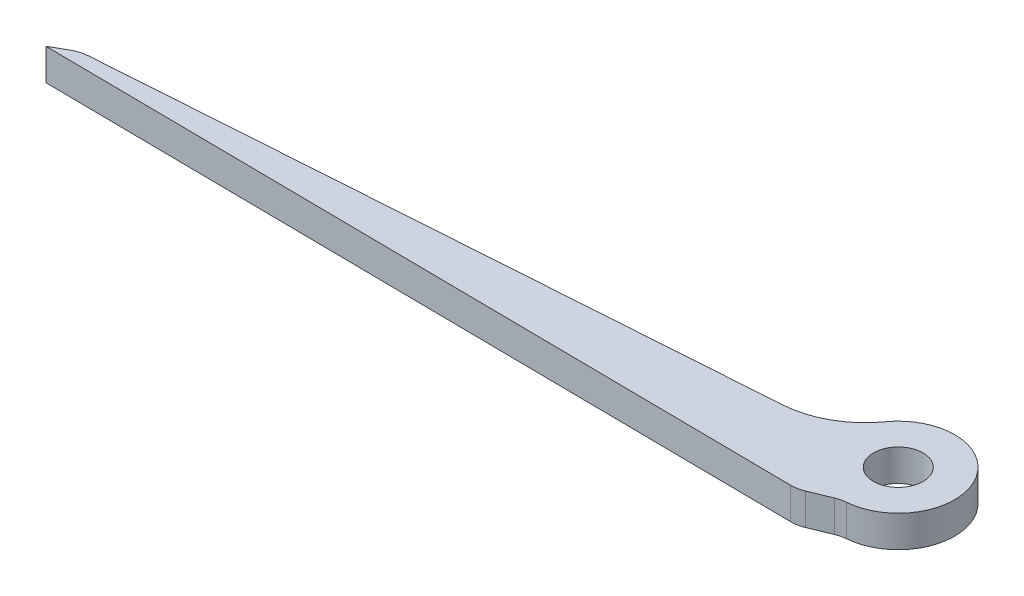
ISO-10303-21;
HEADER;
FILE_DESCRIPTION(('STEP AP214'),'2;1');
FILE_NAME('part.step','',(''),(''),'','','');
FILE_SCHEMA(('AUTOMOTIVE_DESIGN { 1 0 10303 214 1 1 1 1 }'));
ENDSEC;
DATA;
#1=APPLICATION_CONTEXT('core data for automotive mechanical design processes');
#2=APPLICATION_PROTOCOL_DEFINITION('international standard','automotive_design',2000,#1);
#3=PRODUCT_CONTEXT('',#1,'mechanical');
#4=PRODUCT('Part','Part','',(#3));
#5=PRODUCT_RELATED_PRODUCT_CATEGORY('part','',(#4));
#6=PRODUCT_DEFINITION_FORMATION('','',#4);
#7=PRODUCT_DEFINITION_CONTEXT('part definition',#1,'design');
#8=PRODUCT_DEFINITION('design','',#6,#7);
#9=PRODUCT_DEFINITION_SHAPE('','',#8);
#10=(LENGTH_UNIT() NAMED_UNIT(*) SI_UNIT(.MILLI.,.METRE.));
#11=(NAMED_UNIT(*) PLANE_ANGLE_UNIT() SI_UNIT($,.RADIAN.));
#12=(NAMED_UNIT(*) SI_UNIT($,.STERADIAN.) SOLID_ANGLE_UNIT());
#13=UNCERTAINTY_MEASURE_WITH_UNIT(LENGTH_MEASURE(1.E-05),#10,'distance_accuracy_value','');
#14=(GEOMETRIC_REPRESENTATION_CONTEXT(3) GLOBAL_UNCERTAINTY_ASSIGNED_CONTEXT((#13)) GLOBAL_UNIT_ASSIGNED_CONTEXT((#10,
#11,#12)) REPRESENTATION_CONTEXT('',''));
#15=CARTESIAN_POINT('',(0.,0.,0.));
#16=DIRECTION('',(0.,0.,1.));
#17=DIRECTION('',(1.,0.,0.));
#18=AXIS2_PLACEMENT_3D('',#15,#16,#17);
#19=CARTESIAN_POINT('',(0.,3.175,0.));
#20=DIRECTION('',(0.,1.,0.));
#21=DIRECTION('',(0.,0.,1.));
#22=AXIS2_PLACEMENT_3D('',#19,#20,#21);
#23=PLANE('',#22);
#24=CARTESIAN_POINT('',(0.,3.175,0.));
#25=DIRECTION('',(0.,1.,0.));
#26=DIRECTION('',(0.,0.,1.));
#27=AXIS2_PLACEMENT_3D('',#24,#25,#26);
#28=CIRCLE('',#27,5.6642);
#29=CARTESIAN_POINT('',(0.444946616900004,3.175,5.64669674660409));
#30=VERTEX_POINT('',#29);
#31=CARTESIAN_POINT('',(-4.60174845221113,3.175,-3.30258577823082));
#32=VERTEX_POINT('',#31);
#33=EDGE_CURVE('E162',#30,#32,#28,.T.);
#34=ORIENTED_EDGE('',*,*,#33,.T.);
#35=CARTESIAN_POINT('',(-11.8242236014214,3.175,-8.48601637186662));
#36=DIRECTION('',(0.,1.,0.));
#37=DIRECTION('',(0.,0.,1.));
#38=AXIS2_PLACEMENT_3D('',#35,#36,#37);
#39=CIRCLE('',#38,8.89);
#40=CARTESIAN_POINT('',(-11.2121421211736,3.175,0.382887521035677));
#41=VERTEX_POINT('',#40);
#42=EDGE_CURVE('E11',#32,#41,#39,.F.);
#43=ORIENTED_EDGE('',*,*,#42,.T.);
#44=DIRECTION('',(-0.997626984578437,0.,0.0688505602078505));
#45=VECTOR('',#44,1.);
#46=CARTESIAN_POINT('',(-5.6642,3.175,0.));
#47=LINE('',#46,#45);
#48=CARTESIAN_POINT('',(-76.4638174473622,3.175,4.8861883239979));
#49=VERTEX_POINT('',#48);
#50=EDGE_CURVE('E123',#41,#49,#47,.T.);
#51=ORIENTED_EDGE('',*,*,#50,.T.);
#52=CARTESIAN_POINT('',(-76.2452169187023,3.175,8.05365400003444));
#53=DIRECTION('',(0.,1.,0.));
#54=DIRECTION('',(0.,0.,1.));
#55=AXIS2_PLACEMENT_3D('',#52,#53,#54);
#56=CIRCLE('',#55,3.175);
#57=CARTESIAN_POINT('',(-77.8039136184842,3.175,5.28759369734959));
#58=VERTEX_POINT('',#57);
#59=EDGE_CURVE('E118',#49,#58,#56,.T.);
#60=ORIENTED_EDGE('',*,*,#59,.T.);
#61=DIRECTION('',(-0.871200095333811,0.,0.490928094419497));
#62=VECTOR('',#61,1.);
#63=CARTESIAN_POINT('',(-77.1791945502583,3.175,4.93555959708459));
#64=LINE('',#63,#62);
#65=CARTESIAN_POINT('',(-79.3920427924062,3.175,6.18251695691011));
#66=VERTEX_POINT('',#65);
#67=EDGE_CURVE('E111',#58,#66,#64,.T.);
#68=ORIENTED_EDGE('',*,*,#67,.T.);
#69=DIRECTION('',(0.999945461548254,0.,0.0104438464681303));
#70=VECTOR('',#69,1.);
#71=CARTESIAN_POINT('',(-79.3920427924062,3.175,6.18251695691011));
#72=LINE('',#71,#70);
#73=CARTESIAN_POINT('',(-3.83726556900571,3.175,6.97164248784978));
#74=VERTEX_POINT('',#73);
#75=EDGE_CURVE('E115',#66,#74,#72,.T.);
#76=ORIENTED_EDGE('',*,*,#75,.T.);
#77=CARTESIAN_POINT('',(-3.80410635646939,3.175,3.79681564743408));
#78=DIRECTION('',(0.,1.,0.));
#79=DIRECTION('',(0.,0.,1.));
#80=AXIS2_PLACEMENT_3D('',#77,#78,#79);
#81=CIRCLE('',#80,3.175);
#82=CARTESIAN_POINT('',(-2.59537443766945,3.175,6.73272984040263));
#83=VERTEX_POINT('',#82);
#84=EDGE_CURVE('E177',#74,#83,#81,.T.);
#85=ORIENTED_EDGE('',*,*,#84,.T.);
#86=DIRECTION('',(0.924697383612144,0.,-0.380702966551163));
#87=VECTOR('',#86,1.);
#88=CARTESIAN_POINT('',(-3.19204279240622,3.175,6.9783814629996));
#89=LINE('',#88,#87);
#90=CARTESIAN_POINT('',(-0.514375763278859,3.175,5.87597131294276));
#91=VERTEX_POINT('',#90);
#92=EDGE_CURVE('E135',#83,#91,#89,.T.);
#93=ORIENTED_EDGE('',*,*,#92,.T.);
#94=CARTESIAN_POINT('',(0.694356155521082,3.175,8.81188550591132));
#95=DIRECTION('',(0.,1.,0.));
#96=DIRECTION('',(0.,0.,1.));
#97=AXIS2_PLACEMENT_3D('',#94,#95,#96);
#98=CIRCLE('',#97,3.175);
#99=EDGE_CURVE('E198',#91,#30,#98,.F.);
#100=ORIENTED_EDGE('',*,*,#99,.T.);
#101=EDGE_LOOP('',(#34,#43,#51,#60,#68,#76,#85,#93,#100));
#102=FACE_BOUND('',#101,.T.);
#103=CARTESIAN_POINT('',(0.,3.175,0.));
#104=DIRECTION('',(0.,1.,0.));
#105=DIRECTION('',(0.,0.,1.));
#106=AXIS2_PLACEMENT_3D('',#103,#104,#105);
#107=CIRCLE('',#106,2.4892);
#108=CARTESIAN_POINT('',(0.,3.175,2.4892));
#109=VERTEX_POINT('',#108);
#110=EDGE_CURVE('E151',#109,#109,#107,.T.);
#111=ORIENTED_EDGE('',*,*,#110,.F.);
#112=EDGE_LOOP('',(#111));
#113=FACE_BOUND('',#112,.T.);
#114=ADVANCED_FACE('F39',(#102,#113),#23,.T.);
#115=CARTESIAN_POINT('',(0.,0.,0.));
#116=DIRECTION('',(0.,1.,0.));
#117=DIRECTION('',(0.,0.,1.));
#118=AXIS2_PLACEMENT_3D('',#115,#116,#117);
#119=PLANE('',#118);
#120=DIRECTION('',(-0.871200095333811,0.,0.490928094419497));
#121=VECTOR('',#120,1.);
#122=CARTESIAN_POINT('',(-77.1791945502583,0.,4.93555959708459));
#123=LINE('',#122,#121);
#124=CARTESIAN_POINT('',(-77.8039136184842,0.,5.28759369734959));
#125=VERTEX_POINT('',#124);
#126=CARTESIAN_POINT('',(-79.3920427924062,0.,6.18251695691011));
#127=VERTEX_POINT('',#126);
#128=EDGE_CURVE('E129',#125,#127,#123,.T.);
#129=ORIENTED_EDGE('',*,*,#128,.F.);
#130=CARTESIAN_POINT('',(-76.2452169187023,0.,8.05365400003444));
#131=DIRECTION('',(0.,1.,0.));
#132=DIRECTION('',(0.,0.,1.));
#133=AXIS2_PLACEMENT_3D('',#130,#131,#132);
#134=CIRCLE('',#133,3.175);
#135=CARTESIAN_POINT('',(-76.4638174473622,0.,4.8861883239979));
#136=VERTEX_POINT('',#135);
#137=EDGE_CURVE('E169',#125,#136,#134,.F.);
#138=ORIENTED_EDGE('',*,*,#137,.T.);
#139=DIRECTION('',(-0.997626984578437,0.,0.0688505602078505));
#140=VECTOR('',#139,1.);
#141=CARTESIAN_POINT('',(-5.6642,0.,0.));
#142=LINE('',#141,#140);
#143=CARTESIAN_POINT('',(-11.2121421211736,0.,0.382887521035677));
#144=VERTEX_POINT('',#143);
#145=EDGE_CURVE('E150',#144,#136,#142,.T.);
#146=ORIENTED_EDGE('',*,*,#145,.F.);
#147=CARTESIAN_POINT('',(-11.8242236014214,0.,-8.48601637186662));
#148=DIRECTION('',(0.,1.,0.));
#149=DIRECTION('',(0.,0.,1.));
#150=AXIS2_PLACEMENT_3D('',#147,#148,#149);
#151=CIRCLE('',#150,8.89);
#152=CARTESIAN_POINT('',(-4.60174845221113,0.,-3.30258577823082));
#153=VERTEX_POINT('',#152);
#154=EDGE_CURVE('E48',#144,#153,#151,.T.);
#155=ORIENTED_EDGE('',*,*,#154,.T.);
#156=CARTESIAN_POINT('',(0.,0.,0.));
#157=DIRECTION('',(0.,1.,0.));
#158=DIRECTION('',(0.,0.,1.));
#159=AXIS2_PLACEMENT_3D('',#156,#157,#158);
#160=CIRCLE('',#159,5.6642);
#161=CARTESIAN_POINT('',(0.444946616900004,0.,5.64669674660409));
#162=VERTEX_POINT('',#161);
#163=EDGE_CURVE('E147',#162,#153,#160,.T.);
#164=ORIENTED_EDGE('',*,*,#163,.F.);
#165=CARTESIAN_POINT('',(0.694356155521082,0.,8.81188550591132));
#166=DIRECTION('',(0.,1.,0.));
#167=DIRECTION('',(0.,0.,1.));
#168=AXIS2_PLACEMENT_3D('',#165,#166,#167);
#169=CIRCLE('',#168,3.175);
#170=CARTESIAN_POINT('',(-0.514375763278859,0.,5.87597131294276));
#171=VERTEX_POINT('',#170);
#172=EDGE_CURVE('E195',#162,#171,#169,.T.);
#173=ORIENTED_EDGE('',*,*,#172,.T.);
#174=DIRECTION('',(0.924697383612144,0.,-0.380702966551163));
#175=VECTOR('',#174,1.);
#176=CARTESIAN_POINT('',(-3.19204279240622,0.,6.9783814629996));
#177=LINE('',#176,#175);
#178=CARTESIAN_POINT('',(-2.59537443766945,0.,6.73272984040263));
#179=VERTEX_POINT('',#178);
#180=EDGE_CURVE('E159',#179,#171,#177,.T.);
#181=ORIENTED_EDGE('',*,*,#180,.F.);
#182=CARTESIAN_POINT('',(-3.80410635646939,0.,3.79681564743408));
#183=DIRECTION('',(0.,1.,0.));
#184=DIRECTION('',(0.,0.,1.));
#185=AXIS2_PLACEMENT_3D('',#182,#183,#184);
#186=CIRCLE('',#185,3.175);
#187=CARTESIAN_POINT('',(-3.83726556900571,0.,6.97164248784978));
#188=VERTEX_POINT('',#187);
#189=EDGE_CURVE('E166',#179,#188,#186,.F.);
#190=ORIENTED_EDGE('',*,*,#189,.T.);
#191=DIRECTION('',(0.999945461548254,0.,0.0104438464681303));
#192=VECTOR('',#191,1.);
#193=CARTESIAN_POINT('',(-79.3920427924062,0.,6.18251695691011));
#194=LINE('',#193,#192);
#195=EDGE_CURVE('E156',#127,#188,#194,.T.);
#196=ORIENTED_EDGE('',*,*,#195,.F.);
#197=EDGE_LOOP('',(#129,#138,#146,#155,#164,#173,#181,#190,#196));
#198=FACE_BOUND('',#197,.T.);
#199=CARTESIAN_POINT('',(0.,0.,0.));
#200=DIRECTION('',(0.,1.,0.));
#201=DIRECTION('',(0.,0.,1.));
#202=AXIS2_PLACEMENT_3D('',#199,#200,#201);
#203=CIRCLE('',#202,2.4892);
#204=CARTESIAN_POINT('',(0.,0.,2.4892));
#205=VERTEX_POINT('',#204);
#206=EDGE_CURVE('E258',#205,#205,#203,.T.);
#207=ORIENTED_EDGE('',*,*,#206,.T.);
#208=EDGE_LOOP('',(#207));
#209=FACE_BOUND('',#208,.T.);
#210=ADVANCED_FACE('F213',(#198,#209),#119,.F.);
#211=CARTESIAN_POINT('',(0.,3.175,0.));
#212=DIRECTION('',(0.,-1.,0.));
#213=DIRECTION('',(0.,0.,-1.));
#214=AXIS2_PLACEMENT_3D('',#211,#212,#213);
#215=CYLINDRICAL_SURFACE('',#214,5.6642);
#216=ORIENTED_EDGE('',*,*,#163,.T.);
#217=DIRECTION('',(0.,-1.,0.));
#218=VECTOR('',#217,1.);
#219=CARTESIAN_POINT('',(-4.60174845221113,3.175,-3.30258577823082));
#220=LINE('',#219,#218);
#221=EDGE_CURVE('E61',#153,#32,#220,.F.);
#222=ORIENTED_EDGE('',*,*,#221,.T.);
#223=ORIENTED_EDGE('',*,*,#33,.F.);
#224=DIRECTION('',(0.,-1.,0.));
#225=VECTOR('',#224,1.);
#226=CARTESIAN_POINT('',(0.444946616900004,3.175,5.64669674660409));
#227=LINE('',#226,#225);
#228=EDGE_CURVE('E191',#30,#162,#227,.T.);
#229=ORIENTED_EDGE('',*,*,#228,.T.);
#230=EDGE_LOOP('',(#216,#222,#223,#229));
#231=FACE_BOUND('',#230,.T.);
#232=ADVANCED_FACE('F238',(#231),#215,.T.);
#233=CARTESIAN_POINT('',(-5.6642,3.175,0.));
#234=DIRECTION('',(0.0688505602078505,0.,0.997626984578437));
#235=DIRECTION('',(0.997626984578437,0.,-0.0688505602078505));
#236=AXIS2_PLACEMENT_3D('',#233,#234,#235);
#237=PLANE('',#236);
#238=ORIENTED_EDGE('',*,*,#50,.F.);
#239=DIRECTION('',(0.,1.,0.));
#240=VECTOR('',#239,1.);
#241=CARTESIAN_POINT('',(-11.2121421211736,0.,0.382887521035675));
#242=LINE('',#241,#240);
#243=EDGE_CURVE('E201',#41,#144,#242,.F.);
#244=ORIENTED_EDGE('',*,*,#243,.T.);
#245=ORIENTED_EDGE('',*,*,#145,.T.);
#246=DIRECTION('',(0.,-1.,0.));
#247=VECTOR('',#246,1.);
#248=CARTESIAN_POINT('',(-76.4638174473622,3.175,4.8861883239979));
#249=LINE('',#248,#247);
#250=EDGE_CURVE('E173',#136,#49,#249,.F.);
#251=ORIENTED_EDGE('',*,*,#250,.T.);
#252=EDGE_LOOP('',(#238,#244,#245,#251));
#253=FACE_BOUND('',#252,.T.);
#254=ADVANCED_FACE('F210',(#253),#237,.F.);
#255=CARTESIAN_POINT('',(-77.1791945502583,3.175,4.93555959708459));
#256=DIRECTION('',(0.490928094419497,0.,0.871200095333811));
#257=DIRECTION('',(0.871200095333811,0.,-0.490928094419497));
#258=AXIS2_PLACEMENT_3D('',#255,#256,#257);
#259=PLANE('',#258);
#260=ORIENTED_EDGE('',*,*,#67,.F.);
#261=DIRECTION('',(0.,-1.,0.));
#262=VECTOR('',#261,1.);
#263=CARTESIAN_POINT('',(-77.8039136184842,3.175,5.28759369734959));
#264=LINE('',#263,#262);
#265=EDGE_CURVE('E134',#58,#125,#264,.T.);
#266=ORIENTED_EDGE('',*,*,#265,.T.);
#267=ORIENTED_EDGE('',*,*,#128,.T.);
#268=DIRECTION('',(0.,-1.,0.));
#269=VECTOR('',#268,1.);
#270=CARTESIAN_POINT('',(-79.3920427924062,3.175,6.18251695691011));
#271=LINE('',#270,#269);
#272=EDGE_CURVE('E126',#66,#127,#271,.T.);
#273=ORIENTED_EDGE('',*,*,#272,.F.);
#274=EDGE_LOOP('',(#260,#266,#267,#273));
#275=FACE_BOUND('',#274,.T.);
#276=ADVANCED_FACE('F127',(#275),#259,.F.);
#277=CARTESIAN_POINT('',(-79.3920427924062,3.175,6.18251695691011));
#278=DIRECTION('',(0.0104438464681303,0.,-0.999945461548254));
#279=DIRECTION('',(-0.999945461548254,0.,-0.0104438464681303));
#280=AXIS2_PLACEMENT_3D('',#277,#278,#279);
#281=PLANE('',#280);
#282=ORIENTED_EDGE('',*,*,#195,.T.);
#283=DIRECTION('',(0.,-1.,0.));
#284=VECTOR('',#283,1.);
#285=CARTESIAN_POINT('',(-3.83726556900571,3.175,6.97164248784978));
#286=LINE('',#285,#284);
#287=EDGE_CURVE('E139',#188,#74,#286,.F.);
#288=ORIENTED_EDGE('',*,*,#287,.T.);
#289=ORIENTED_EDGE('',*,*,#75,.F.);
#290=ORIENTED_EDGE('',*,*,#272,.T.);
#291=EDGE_LOOP('',(#282,#288,#289,#290));
#292=FACE_BOUND('',#291,.T.);
#293=ADVANCED_FACE('F137',(#292),#281,.F.);
#294=CARTESIAN_POINT('',(-3.19204279240622,3.175,6.9783814629996));
#295=DIRECTION('',(-0.380702966551163,0.,-0.924697383612144));
#296=DIRECTION('',(-0.924697383612144,0.,0.380702966551163));
#297=AXIS2_PLACEMENT_3D('',#294,#295,#296);
#298=PLANE('',#297);
#299=ORIENTED_EDGE('',*,*,#92,.F.);
#300=DIRECTION('',(0.,-1.,0.));
#301=VECTOR('',#300,1.);
#302=CARTESIAN_POINT('',(-2.59537443766945,3.175,6.73272984040263));
#303=LINE('',#302,#301);
#304=EDGE_CURVE('E185',#83,#179,#303,.T.);
#305=ORIENTED_EDGE('',*,*,#304,.T.);
#306=ORIENTED_EDGE('',*,*,#180,.T.);
#307=DIRECTION('',(0.,1.,0.));
#308=VECTOR('',#307,1.);
#309=CARTESIAN_POINT('',(-0.514375763278859,3.175,5.87597131294276));
#310=LINE('',#309,#308);
#311=EDGE_CURVE('E182',#171,#91,#310,.T.);
#312=ORIENTED_EDGE('',*,*,#311,.T.);
#313=EDGE_LOOP('',(#299,#305,#306,#312));
#314=FACE_BOUND('',#313,.T.);
#315=ADVANCED_FACE('F229',(#314),#298,.F.);
#316=CARTESIAN_POINT('',(0.,3.175,0.));
#317=DIRECTION('',(0.,-1.,0.));
#318=DIRECTION('',(0.,0.,-1.));
#319=AXIS2_PLACEMENT_3D('',#316,#317,#318);
#320=CYLINDRICAL_SURFACE('',#319,2.4892);
#321=ORIENTED_EDGE('',*,*,#110,.T.);
#322=EDGE_LOOP('',(#321));
#323=FACE_BOUND('',#322,.T.);
#324=ORIENTED_EDGE('',*,*,#206,.F.);
#325=EDGE_LOOP('',(#324));
#326=FACE_BOUND('',#325,.T.);
#327=ADVANCED_FACE('F220',(#323,#326),#320,.F.);
#328=CARTESIAN_POINT('',(-76.2452169187023,3.175,8.05365400003444));
#329=DIRECTION('',(0.,-1.,0.));
#330=DIRECTION('',(0.,0.,-1.));
#331=AXIS2_PLACEMENT_3D('',#328,#329,#330);
#332=CYLINDRICAL_SURFACE('',#331,3.175);
#333=ORIENTED_EDGE('',*,*,#59,.F.);
#334=ORIENTED_EDGE('',*,*,#250,.F.);
#335=ORIENTED_EDGE('',*,*,#137,.F.);
#336=ORIENTED_EDGE('',*,*,#265,.F.);
#337=EDGE_LOOP('',(#333,#334,#335,#336));
#338=FACE_BOUND('',#337,.T.);
#339=ADVANCED_FACE('F217',(#338),#332,.T.);
#340=CARTESIAN_POINT('',(-3.80410635646939,3.175,3.79681564743408));
#341=DIRECTION('',(0.,-1.,0.));
#342=DIRECTION('',(0.,0.,-1.));
#343=AXIS2_PLACEMENT_3D('',#340,#341,#342);
#344=CYLINDRICAL_SURFACE('',#343,3.175);
#345=ORIENTED_EDGE('',*,*,#84,.F.);
#346=ORIENTED_EDGE('',*,*,#287,.F.);
#347=ORIENTED_EDGE('',*,*,#189,.F.);
#348=ORIENTED_EDGE('',*,*,#304,.F.);
#349=EDGE_LOOP('',(#345,#346,#347,#348));
#350=FACE_BOUND('',#349,.T.);
#351=ADVANCED_FACE('F219',(#350),#344,.T.);
#352=CARTESIAN_POINT('',(0.694356155521082,3.175,8.81188550591132));
#353=DIRECTION('',(0.,-1.,0.));
#354=DIRECTION('',(0.,0.,-1.));
#355=AXIS2_PLACEMENT_3D('',#352,#353,#354);
#356=CYLINDRICAL_SURFACE('',#355,3.175);
#357=ORIENTED_EDGE('',*,*,#99,.F.);
#358=ORIENTED_EDGE('',*,*,#311,.F.);
#359=ORIENTED_EDGE('',*,*,#172,.F.);
#360=ORIENTED_EDGE('',*,*,#228,.F.);
#361=EDGE_LOOP('',(#357,#358,#359,#360));
#362=FACE_BOUND('',#361,.T.);
#363=ADVANCED_FACE('F226',(#362),#356,.F.);
#364=CARTESIAN_POINT('',(-11.8242236014214,3.175,-8.48601637186662));
#365=DIRECTION('',(0.,-1.,0.));
#366=DIRECTION('',(0.,0.,-1.));
#367=AXIS2_PLACEMENT_3D('',#364,#365,#366);
#368=CYLINDRICAL_SURFACE('',#367,8.89);
#369=ORIENTED_EDGE('',*,*,#42,.F.);
#370=ORIENTED_EDGE('',*,*,#221,.F.);
#371=ORIENTED_EDGE('',*,*,#154,.F.);
#372=ORIENTED_EDGE('',*,*,#243,.F.);
#373=EDGE_LOOP('',(#369,#370,#371,#372));
#374=FACE_BOUND('',#373,.T.);
#375=ADVANCED_FACE('F41',(#374),#368,.F.);
#376=CLOSED_SHELL('',(#114,#210,#232,#254,#276,#293,#315,#327,#339,#351,#363,#375));
#377=MANIFOLD_SOLID_BREP('B2',#376);
#378=ADVANCED_BREP_SHAPE_REPRESENTATION('',(#18,#377),#14);
#379=SHAPE_DEFINITION_REPRESENTATION(#9,#378);
ENDSEC;
END-ISO-10303-21;
